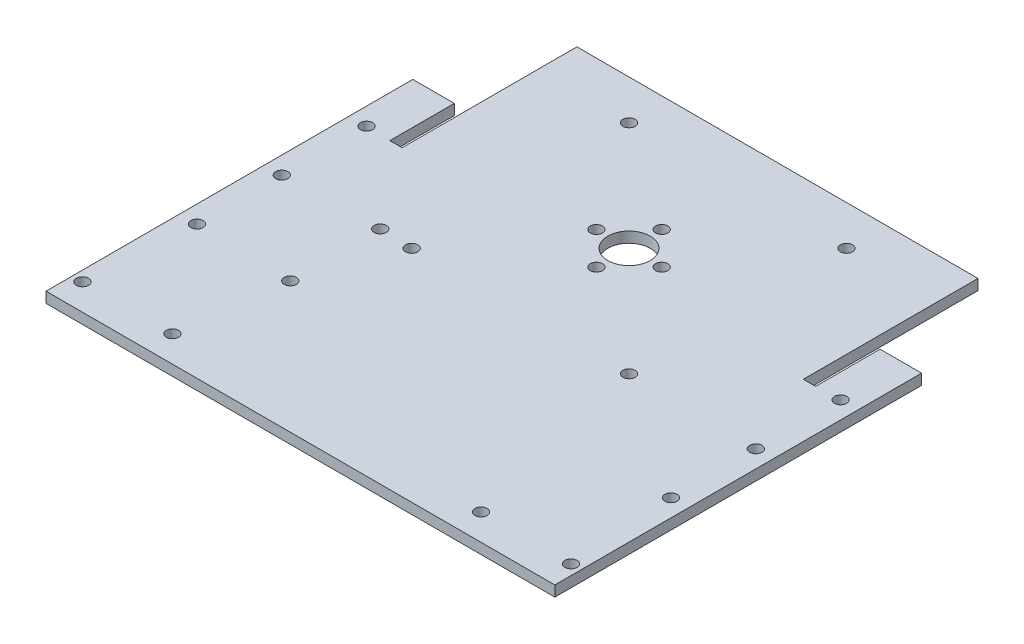
ISO-10303-21;
HEADER;
FILE_DESCRIPTION(('STEP AP214'),'2;1');
FILE_NAME('part.step','',(''),(''),'','','');
FILE_SCHEMA(('AUTOMOTIVE_DESIGN { 1 0 10303 214 1 1 1 1 }'));
ENDSEC;
DATA;
#1=APPLICATION_CONTEXT('core data for automotive mechanical design processes');
#2=APPLICATION_PROTOCOL_DEFINITION('international standard','automotive_design',2000,#1);
#3=PRODUCT_CONTEXT('',#1,'mechanical');
#4=PRODUCT('Part','Part','',(#3));
#5=PRODUCT_RELATED_PRODUCT_CATEGORY('part','',(#4));
#6=PRODUCT_DEFINITION_FORMATION('','',#4);
#7=PRODUCT_DEFINITION_CONTEXT('part definition',#1,'design');
#8=PRODUCT_DEFINITION('design','',#6,#7);
#9=PRODUCT_DEFINITION_SHAPE('','',#8);
#10=(LENGTH_UNIT() NAMED_UNIT(*) SI_UNIT(.MILLI.,.METRE.));
#11=(NAMED_UNIT(*) PLANE_ANGLE_UNIT() SI_UNIT($,.RADIAN.));
#12=(NAMED_UNIT(*) SI_UNIT($,.STERADIAN.) SOLID_ANGLE_UNIT());
#13=UNCERTAINTY_MEASURE_WITH_UNIT(LENGTH_MEASURE(1.E-05),#10,'distance_accuracy_value','');
#14=(GEOMETRIC_REPRESENTATION_CONTEXT(3) GLOBAL_UNCERTAINTY_ASSIGNED_CONTEXT((#13)) GLOBAL_UNIT_ASSIGNED_CONTEXT((#10,
#11,#12)) REPRESENTATION_CONTEXT('',''));
#15=CARTESIAN_POINT('',(0.,0.,0.));
#16=DIRECTION('',(0.,0.,1.));
#17=DIRECTION('',(1.,0.,0.));
#18=AXIS2_PLACEMENT_3D('',#15,#16,#17);
#19=CARTESIAN_POINT('',(76.2,3.175,-44.45));
#20=DIRECTION('',(0.,0.,1.));
#21=DIRECTION('',(1.,0.,0.));
#22=AXIS2_PLACEMENT_3D('',#19,#20,#21);
#23=PLANE('',#22);
#24=DIRECTION('',(-1.,0.,0.));
#25=VECTOR('',#24,1.);
#26=CARTESIAN_POINT('',(76.2,3.175,-44.45));
#27=LINE('',#26,#25);
#28=CARTESIAN_POINT('',(-63.754,3.175,-44.45));
#29=VERTEX_POINT('',#28);
#30=CARTESIAN_POINT('',(-76.2,3.175,-44.45));
#31=VERTEX_POINT('',#30);
#32=EDGE_CURVE('E268',#29,#31,#27,.T.);
#33=ORIENTED_EDGE('',*,*,#32,.F.);
#34=DIRECTION('',(0.,1.,0.));
#35=VECTOR('',#34,1.);
#36=CARTESIAN_POINT('',(-63.754,0.,-44.45));
#37=LINE('',#36,#35);
#38=CARTESIAN_POINT('',(-63.754,0.,-44.45));
#39=VERTEX_POINT('',#38);
#40=EDGE_CURVE('E214',#39,#29,#37,.T.);
#41=ORIENTED_EDGE('',*,*,#40,.F.);
#42=DIRECTION('',(-1.,0.,0.));
#43=VECTOR('',#42,1.);
#44=CARTESIAN_POINT('',(76.2,0.,-44.45));
#45=LINE('',#44,#43);
#46=CARTESIAN_POINT('',(-76.2,0.,-44.45));
#47=VERTEX_POINT('',#46);
#48=EDGE_CURVE('E275',#39,#47,#45,.T.);
#49=ORIENTED_EDGE('',*,*,#48,.T.);
#50=DIRECTION('',(0.,-1.,0.));
#51=VECTOR('',#50,1.);
#52=CARTESIAN_POINT('',(-76.2,3.175,-44.45));
#53=LINE('',#52,#51);
#54=EDGE_CURVE('E41',#31,#47,#53,.T.);
#55=ORIENTED_EDGE('',*,*,#54,.F.);
#56=EDGE_LOOP('',(#33,#41,#49,#55));
#57=FACE_BOUND('',#56,.T.);
#58=ADVANCED_FACE('F33',(#57),#23,.F.);
#59=CARTESIAN_POINT('',(-76.2,3.175,44.45));
#60=DIRECTION('',(1.,0.,0.));
#61=DIRECTION('',(0.,0.,-1.));
#62=AXIS2_PLACEMENT_3D('',#59,#60,#61);
#63=PLANE('',#62);
#64=DIRECTION('',(0.,0.,1.));
#65=VECTOR('',#64,1.);
#66=CARTESIAN_POINT('',(-76.2,0.,44.45));
#67=LINE('',#66,#65);
#68=CARTESIAN_POINT('',(-76.2,0.,65.405));
#69=VERTEX_POINT('',#68);
#70=EDGE_CURVE('E260',#47,#69,#67,.T.);
#71=ORIENTED_EDGE('',*,*,#70,.T.);
#72=DIRECTION('',(0.,1.,0.));
#73=VECTOR('',#72,1.);
#74=CARTESIAN_POINT('',(-76.2,0.,65.405));
#75=LINE('',#74,#73);
#76=CARTESIAN_POINT('',(-76.2,3.175,65.405));
#77=VERTEX_POINT('',#76);
#78=EDGE_CURVE('E183',#69,#77,#75,.T.);
#79=ORIENTED_EDGE('',*,*,#78,.T.);
#80=DIRECTION('',(0.,0.,1.));
#81=VECTOR('',#80,1.);
#82=CARTESIAN_POINT('',(-76.2,3.175,44.45));
#83=LINE('',#82,#81);
#84=EDGE_CURVE('E263',#31,#77,#83,.T.);
#85=ORIENTED_EDGE('',*,*,#84,.F.);
#86=ORIENTED_EDGE('',*,*,#54,.T.);
#87=EDGE_LOOP('',(#71,#79,#85,#86));
#88=FACE_BOUND('',#87,.T.);
#89=ADVANCED_FACE('F35',(#88),#63,.F.);
#90=CARTESIAN_POINT('',(76.2,3.175,44.45));
#91=DIRECTION('',(-1.,0.,0.));
#92=DIRECTION('',(0.,0.,1.));
#93=AXIS2_PLACEMENT_3D('',#90,#91,#92);
#94=PLANE('',#93);
#95=DIRECTION('',(0.,0.,-1.));
#96=VECTOR('',#95,1.);
#97=CARTESIAN_POINT('',(76.2,0.,44.45));
#98=LINE('',#97,#96);
#99=CARTESIAN_POINT('',(76.2,0.,65.405));
#100=VERTEX_POINT('',#99);
#101=CARTESIAN_POINT('',(76.2,0.,-44.45));
#102=VERTEX_POINT('',#101);
#103=EDGE_CURVE('E273',#100,#102,#98,.T.);
#104=ORIENTED_EDGE('',*,*,#103,.T.);
#105=DIRECTION('',(0.,-1.,0.));
#106=VECTOR('',#105,1.);
#107=CARTESIAN_POINT('',(76.2,3.175,-44.45));
#108=LINE('',#107,#106);
#109=CARTESIAN_POINT('',(76.2,3.175,-44.45));
#110=VERTEX_POINT('',#109);
#111=EDGE_CURVE('E11',#110,#102,#108,.T.);
#112=ORIENTED_EDGE('',*,*,#111,.F.);
#113=DIRECTION('',(0.,0.,-1.));
#114=VECTOR('',#113,1.);
#115=CARTESIAN_POINT('',(76.2,3.175,44.45));
#116=LINE('',#115,#114);
#117=CARTESIAN_POINT('',(76.2,3.175,65.405));
#118=VERTEX_POINT('',#117);
#119=EDGE_CURVE('E265',#118,#110,#116,.T.);
#120=ORIENTED_EDGE('',*,*,#119,.F.);
#121=DIRECTION('',(0.,1.,0.));
#122=VECTOR('',#121,1.);
#123=CARTESIAN_POINT('',(76.2,0.,65.405));
#124=LINE('',#123,#122);
#125=EDGE_CURVE('E186',#100,#118,#124,.T.);
#126=ORIENTED_EDGE('',*,*,#125,.F.);
#127=EDGE_LOOP('',(#104,#112,#120,#126));
#128=FACE_BOUND('',#127,.T.);
#129=ADVANCED_FACE('F327',(#128),#94,.F.);
#130=CARTESIAN_POINT('',(63.754,0.,-44.4499999999999));
#131=VERTEX_POINT('',#130);
#132=EDGE_CURVE('E266',#102,#131,#45,.T.);
#133=ORIENTED_EDGE('',*,*,#132,.T.);
#134=DIRECTION('',(0.,1.,0.));
#135=VECTOR('',#134,1.);
#136=CARTESIAN_POINT('',(63.754,0.,-44.4499999999999));
#137=LINE('',#136,#135);
#138=CARTESIAN_POINT('',(63.754,3.175,-44.4499999999999));
#139=VERTEX_POINT('',#138);
#140=EDGE_CURVE('E201',#131,#139,#137,.T.);
#141=ORIENTED_EDGE('',*,*,#140,.T.);
#142=EDGE_CURVE('E269',#110,#139,#27,.T.);
#143=ORIENTED_EDGE('',*,*,#142,.F.);
#144=ORIENTED_EDGE('',*,*,#111,.T.);
#145=EDGE_LOOP('',(#133,#141,#143,#144));
#146=FACE_BOUND('',#145,.T.);
#147=ADVANCED_FACE('F321',(#146),#23,.F.);
#148=CARTESIAN_POINT('',(0.,3.175,0.));
#149=DIRECTION('',(0.,1.,0.));
#150=DIRECTION('',(0.,0.,1.));
#151=AXIS2_PLACEMENT_3D('',#148,#149,#150);
#152=PLANE('',#151);
#153=CARTESIAN_POINT('',(-42.291,3.175,-0.787399999999994));
#154=DIRECTION('',(0.,-1.,0.));
#155=DIRECTION('',(0.,0.,-1.));
#156=AXIS2_PLACEMENT_3D('',#153,#154,#155);
#157=CIRCLE('',#156,1.8288);
#158=CARTESIAN_POINT('',(-42.291,3.175,-2.61619999999999));
#159=VERTEX_POINT('',#158);
#160=EDGE_CURVE('E422',#159,#159,#157,.T.);
#161=ORIENTED_EDGE('',*,*,#160,.T.);
#162=EDGE_LOOP('',(#161));
#163=FACE_BOUND('',#162,.T.);
#164=CARTESIAN_POINT('',(-42.291,3.175,26.162));
#165=DIRECTION('',(0.,-1.,0.));
#166=DIRECTION('',(0.,0.,-1.));
#167=AXIS2_PLACEMENT_3D('',#164,#165,#166);
#168=CIRCLE('',#167,1.82880000000001);
#169=CARTESIAN_POINT('',(-42.291,3.175,24.3332));
#170=VERTEX_POINT('',#169);
#171=EDGE_CURVE('E431',#170,#170,#168,.T.);
#172=ORIENTED_EDGE('',*,*,#171,.T.);
#173=EDGE_LOOP('',(#172));
#174=FACE_BOUND('',#173,.T.);
#175=CARTESIAN_POINT('',(9.779,3.175,-33.02));
#176=DIRECTION('',(0.,1.,0.));
#177=DIRECTION('',(0.,0.,1.));
#178=AXIS2_PLACEMENT_3D('',#175,#176,#177);
#179=CIRCLE('',#178,1.8288);
#180=CARTESIAN_POINT('',(9.779,3.175,-31.1912));
#181=VERTEX_POINT('',#180);
#182=EDGE_CURVE('E439',#181,#181,#179,.T.);
#183=ORIENTED_EDGE('',*,*,#182,.F.);
#184=EDGE_LOOP('',(#183));
#185=FACE_BOUND('',#184,.T.);
#186=CARTESIAN_POINT('',(0.,3.175,-42.799));
#187=DIRECTION('',(0.,1.,0.));
#188=DIRECTION('',(0.,0.,1.));
#189=AXIS2_PLACEMENT_3D('',#186,#187,#188);
#190=CIRCLE('',#189,1.8288);
#191=CARTESIAN_POINT('',(0.,3.175,-40.9702));
#192=VERTEX_POINT('',#191);
#193=EDGE_CURVE('E445',#192,#192,#190,.T.);
#194=ORIENTED_EDGE('',*,*,#193,.F.);
#195=EDGE_LOOP('',(#194));
#196=FACE_BOUND('',#195,.T.);
#197=CARTESIAN_POINT('',(-9.77899999999999,3.175,-33.02));
#198=DIRECTION('',(0.,1.,0.));
#199=DIRECTION('',(0.,0.,1.));
#200=AXIS2_PLACEMENT_3D('',#197,#198,#199);
#201=CIRCLE('',#200,1.8288);
#202=CARTESIAN_POINT('',(-9.77899999999999,3.175,-31.1912));
#203=VERTEX_POINT('',#202);
#204=EDGE_CURVE('E451',#203,#203,#201,.T.);
#205=ORIENTED_EDGE('',*,*,#204,.F.);
#206=EDGE_LOOP('',(#205));
#207=FACE_BOUND('',#206,.T.);
#208=CARTESIAN_POINT('',(0.,3.175,-23.241));
#209=DIRECTION('',(0.,1.,0.));
#210=DIRECTION('',(0.,0.,1.));
#211=AXIS2_PLACEMENT_3D('',#208,#209,#210);
#212=CIRCLE('',#211,1.8288);
#213=CARTESIAN_POINT('',(0.,3.175,-21.4122));
#214=VERTEX_POINT('',#213);
#215=EDGE_CURVE('E457',#214,#214,#212,.T.);
#216=ORIENTED_EDGE('',*,*,#215,.F.);
#217=EDGE_LOOP('',(#216));
#218=FACE_BOUND('',#217,.T.);
#219=CARTESIAN_POINT('',(32.5501,3.175,-65.5701));
#220=DIRECTION('',(0.,1.,0.));
#221=DIRECTION('',(0.,0.,1.));
#222=AXIS2_PLACEMENT_3D('',#219,#220,#221);
#223=CIRCLE('',#222,1.8288);
#224=CARTESIAN_POINT('',(32.5501,3.175,-63.7413));
#225=VERTEX_POINT('',#224);
#226=EDGE_CURVE('E460',#225,#225,#223,.T.);
#227=ORIENTED_EDGE('',*,*,#226,.F.);
#228=EDGE_LOOP('',(#227));
#229=FACE_BOUND('',#228,.T.);
#230=CARTESIAN_POINT('',(-32.5501,3.175,-65.5701));
#231=DIRECTION('',(0.,1.,0.));
#232=DIRECTION('',(0.,0.,1.));
#233=AXIS2_PLACEMENT_3D('',#230,#231,#232);
#234=CIRCLE('',#233,1.8288);
#235=CARTESIAN_POINT('',(-32.5501,3.175,-63.7413));
#236=VERTEX_POINT('',#235);
#237=EDGE_CURVE('E464',#236,#236,#234,.T.);
#238=ORIENTED_EDGE('',*,*,#237,.F.);
#239=EDGE_LOOP('',(#238));
#240=FACE_BOUND('',#239,.T.);
#241=CARTESIAN_POINT('',(-32.5501,3.175,-0.469900000000034));
#242=DIRECTION('',(0.,1.,0.));
#243=DIRECTION('',(0.,0.,1.));
#244=AXIS2_PLACEMENT_3D('',#241,#242,#243);
#245=CIRCLE('',#244,1.8288);
#246=CARTESIAN_POINT('',(-32.5501,3.175,1.35889999999996));
#247=VERTEX_POINT('',#246);
#248=EDGE_CURVE('E470',#247,#247,#245,.T.);
#249=ORIENTED_EDGE('',*,*,#248,.F.);
#250=EDGE_LOOP('',(#249));
#251=FACE_BOUND('',#250,.T.);
#252=CARTESIAN_POINT('',(32.5501,3.175,-0.469900000000034));
#253=DIRECTION('',(0.,1.,0.));
#254=DIRECTION('',(0.,0.,1.));
#255=AXIS2_PLACEMENT_3D('',#252,#253,#254);
#256=CIRCLE('',#255,1.8288);
#257=CARTESIAN_POINT('',(32.5501,3.175,1.35889999999996));
#258=VERTEX_POINT('',#257);
#259=EDGE_CURVE('E476',#258,#258,#256,.T.);
#260=ORIENTED_EDGE('',*,*,#259,.F.);
#261=EDGE_LOOP('',(#260));
#262=FACE_BOUND('',#261,.T.);
#263=CARTESIAN_POINT('',(0.,3.175,-33.02));
#264=DIRECTION('',(0.,1.,0.));
#265=DIRECTION('',(0.,0.,1.));
#266=AXIS2_PLACEMENT_3D('',#263,#264,#265);
#267=CIRCLE('',#266,6.35);
#268=CARTESIAN_POINT('',(0.,3.175,-26.67));
#269=VERTEX_POINT('',#268);
#270=EDGE_CURVE('E151',#269,#269,#267,.T.);
#271=ORIENTED_EDGE('',*,*,#270,.F.);
#272=EDGE_LOOP('',(#271));
#273=FACE_BOUND('',#272,.T.);
#274=DIRECTION('',(1.,0.,0.));
#275=VECTOR('',#274,1.);
#276=CARTESIAN_POINT('',(60.071,3.175,-25.146));
#277=LINE('',#276,#275);
#278=CARTESIAN_POINT('',(60.071,3.175,-25.146));
#279=VERTEX_POINT('',#278);
#280=CARTESIAN_POINT('',(63.754,3.175,-25.146));
#281=VERTEX_POINT('',#280);
#282=EDGE_CURVE('E197',#279,#281,#277,.T.);
#283=ORIENTED_EDGE('',*,*,#282,.F.);
#284=DIRECTION('',(0.,0.,1.));
#285=VECTOR('',#284,1.);
#286=CARTESIAN_POINT('',(60.071,3.175,-44.4499999999999));
#287=LINE('',#286,#285);
#288=CARTESIAN_POINT('',(60.071,3.175,-77.47));
#289=VERTEX_POINT('',#288);
#290=EDGE_CURVE('E189',#289,#279,#287,.T.);
#291=ORIENTED_EDGE('',*,*,#290,.F.);
#292=DIRECTION('',(-1.,0.,0.));
#293=VECTOR('',#292,1.);
#294=CARTESIAN_POINT('',(60.071,3.175,-77.47));
#295=LINE('',#294,#293);
#296=CARTESIAN_POINT('',(-60.071,3.175,-77.47));
#297=VERTEX_POINT('',#296);
#298=EDGE_CURVE('E139',#289,#297,#295,.T.);
#299=ORIENTED_EDGE('',*,*,#298,.T.);
#300=DIRECTION('',(0.,0.,-1.));
#301=VECTOR('',#300,1.);
#302=CARTESIAN_POINT('',(-60.071,3.175,-25.146));
#303=LINE('',#302,#301);
#304=CARTESIAN_POINT('',(-60.071,3.175,-25.146));
#305=VERTEX_POINT('',#304);
#306=EDGE_CURVE('E211',#305,#297,#303,.T.);
#307=ORIENTED_EDGE('',*,*,#306,.F.);
#308=DIRECTION('',(1.,0.,0.));
#309=VECTOR('',#308,1.);
#310=CARTESIAN_POINT('',(-63.754,3.175,-25.146));
#311=LINE('',#310,#309);
#312=CARTESIAN_POINT('',(-63.754,3.175,-25.146));
#313=VERTEX_POINT('',#312);
#314=EDGE_CURVE('E217',#313,#305,#311,.T.);
#315=ORIENTED_EDGE('',*,*,#314,.F.);
#316=DIRECTION('',(0.,0.,1.));
#317=VECTOR('',#316,1.);
#318=CARTESIAN_POINT('',(-63.754,3.175,-44.45));
#319=LINE('',#318,#317);
#320=EDGE_CURVE('E204',#29,#313,#319,.T.);
#321=ORIENTED_EDGE('',*,*,#320,.F.);
#322=ORIENTED_EDGE('',*,*,#32,.T.);
#323=ORIENTED_EDGE('',*,*,#84,.T.);
#324=DIRECTION('',(1.,0.,0.));
#325=VECTOR('',#324,1.);
#326=CARTESIAN_POINT('',(-76.2,3.175,65.405));
#327=LINE('',#326,#325);
#328=EDGE_CURVE('E177',#77,#118,#327,.T.);
#329=ORIENTED_EDGE('',*,*,#328,.T.);
#330=ORIENTED_EDGE('',*,*,#119,.T.);
#331=ORIENTED_EDGE('',*,*,#142,.T.);
#332=DIRECTION('',(0.,0.,-1.));
#333=VECTOR('',#332,1.);
#334=CARTESIAN_POINT('',(63.754,3.175,-25.146));
#335=LINE('',#334,#333);
#336=EDGE_CURVE('E131',#281,#139,#335,.T.);
#337=ORIENTED_EDGE('',*,*,#336,.F.);
#338=EDGE_LOOP('',(#283,#291,#299,#307,#315,#321,#322,#323,#329,#330,#331,#337));
#339=FACE_BOUND('',#338,.T.);
#340=CARTESIAN_POINT('',(73.1647,3.175,57.531));
#341=DIRECTION('',(0.,1.,0.));
#342=DIRECTION('',(0.,0.,-1.));
#343=AXIS2_PLACEMENT_3D('',#340,#341,#342);
#344=CIRCLE('',#343,1.8288);
#345=CARTESIAN_POINT('',(73.1647,3.175,55.7022));
#346=VERTEX_POINT('',#345);
#347=EDGE_CURVE('E154',#346,#346,#344,.T.);
#348=ORIENTED_EDGE('',*,*,#347,.F.);
#349=EDGE_LOOP('',(#348));
#350=FACE_BOUND('',#349,.T.);
#351=CARTESIAN_POINT('',(46.2153,3.175,57.531));
#352=DIRECTION('',(0.,1.,0.));
#353=DIRECTION('',(0.,0.,-1.));
#354=AXIS2_PLACEMENT_3D('',#351,#352,#353);
#355=CIRCLE('',#354,1.8288);
#356=CARTESIAN_POINT('',(46.2153,3.175,55.7022));
#357=VERTEX_POINT('',#356);
#358=EDGE_CURVE('E159',#357,#357,#355,.T.);
#359=ORIENTED_EDGE('',*,*,#358,.F.);
#360=EDGE_LOOP('',(#359));
#361=FACE_BOUND('',#360,.T.);
#362=CARTESIAN_POINT('',(-46.2153,3.175,57.531));
#363=DIRECTION('',(0.,1.,0.));
#364=DIRECTION('',(0.,0.,1.));
#365=AXIS2_PLACEMENT_3D('',#362,#363,#364);
#366=CIRCLE('',#365,1.8288);
#367=CARTESIAN_POINT('',(-46.2153,3.175,59.3598));
#368=VERTEX_POINT('',#367);
#369=EDGE_CURVE('E165',#368,#368,#366,.T.);
#370=ORIENTED_EDGE('',*,*,#369,.F.);
#371=EDGE_LOOP('',(#370));
#372=FACE_BOUND('',#371,.T.);
#373=CARTESIAN_POINT('',(-73.1647,3.175,57.531));
#374=DIRECTION('',(0.,1.,0.));
#375=DIRECTION('',(0.,0.,1.));
#376=AXIS2_PLACEMENT_3D('',#373,#374,#375);
#377=CIRCLE('',#376,1.8288);
#378=CARTESIAN_POINT('',(-73.1647,3.175,59.3598));
#379=VERTEX_POINT('',#378);
#380=EDGE_CURVE('E171',#379,#379,#377,.T.);
#381=ORIENTED_EDGE('',*,*,#380,.F.);
#382=EDGE_LOOP('',(#381));
#383=FACE_BOUND('',#382,.T.);
#384=CARTESIAN_POINT('',(70.993,3.175,-25.4));
#385=DIRECTION('',(0.,1.,0.));
#386=DIRECTION('',(0.,0.,-1.));
#387=AXIS2_PLACEMENT_3D('',#384,#385,#386);
#388=CIRCLE('',#387,1.8288);
#389=CARTESIAN_POINT('',(70.993,3.175,-27.2288));
#390=VERTEX_POINT('',#389);
#391=EDGE_CURVE('E223',#390,#390,#388,.T.);
#392=ORIENTED_EDGE('',*,*,#391,.F.);
#393=EDGE_LOOP('',(#392));
#394=FACE_BOUND('',#393,.T.);
#395=CARTESIAN_POINT('',(70.993,3.175,0.));
#396=DIRECTION('',(0.,1.,0.));
#397=DIRECTION('',(0.,0.,-1.));
#398=AXIS2_PLACEMENT_3D('',#395,#396,#397);
#399=CIRCLE('',#398,1.82879999999998);
#400=CARTESIAN_POINT('',(70.993,3.175,-1.8288));
#401=VERTEX_POINT('',#400);
#402=EDGE_CURVE('E230',#401,#401,#399,.T.);
#403=ORIENTED_EDGE('',*,*,#402,.F.);
#404=EDGE_LOOP('',(#403));
#405=FACE_BOUND('',#404,.T.);
#406=CARTESIAN_POINT('',(70.993,3.175,25.4));
#407=DIRECTION('',(0.,1.,0.));
#408=DIRECTION('',(0.,0.,-1.));
#409=AXIS2_PLACEMENT_3D('',#406,#407,#408);
#410=CIRCLE('',#409,1.8288);
#411=CARTESIAN_POINT('',(70.993,3.175,23.5712));
#412=VERTEX_POINT('',#411);
#413=EDGE_CURVE('E236',#412,#412,#410,.T.);
#414=ORIENTED_EDGE('',*,*,#413,.F.);
#415=EDGE_LOOP('',(#414));
#416=FACE_BOUND('',#415,.T.);
#417=CARTESIAN_POINT('',(-70.993,3.175,-25.4));
#418=DIRECTION('',(0.,1.,0.));
#419=DIRECTION('',(0.,0.,1.));
#420=AXIS2_PLACEMENT_3D('',#417,#418,#419);
#421=CIRCLE('',#420,1.8288);
#422=CARTESIAN_POINT('',(-70.993,3.175,-23.5712));
#423=VERTEX_POINT('',#422);
#424=EDGE_CURVE('E242',#423,#423,#421,.T.);
#425=ORIENTED_EDGE('',*,*,#424,.F.);
#426=EDGE_LOOP('',(#425));
#427=FACE_BOUND('',#426,.T.);
#428=CARTESIAN_POINT('',(-70.993,3.175,0.));
#429=DIRECTION('',(0.,1.,0.));
#430=DIRECTION('',(0.,0.,1.));
#431=AXIS2_PLACEMENT_3D('',#428,#429,#430);
#432=CIRCLE('',#431,1.8288);
#433=CARTESIAN_POINT('',(-70.993,3.175,1.8288));
#434=VERTEX_POINT('',#433);
#435=EDGE_CURVE('E248',#434,#434,#432,.T.);
#436=ORIENTED_EDGE('',*,*,#435,.F.);
#437=EDGE_LOOP('',(#436));
#438=FACE_BOUND('',#437,.T.);
#439=CARTESIAN_POINT('',(-70.993,3.175,25.4));
#440=DIRECTION('',(0.,1.,0.));
#441=DIRECTION('',(0.,0.,1.));
#442=AXIS2_PLACEMENT_3D('',#439,#440,#441);
#443=CIRCLE('',#442,1.8288);
#444=CARTESIAN_POINT('',(-70.993,3.175,27.2288));
#445=VERTEX_POINT('',#444);
#446=EDGE_CURVE('E254',#445,#445,#443,.T.);
#447=ORIENTED_EDGE('',*,*,#446,.F.);
#448=EDGE_LOOP('',(#447));
#449=FACE_BOUND('',#448,.T.);
#450=ADVANCED_FACE('F294',(#163,#174,#185,#196,#207,#218,#229,#240,#251,#262,#273,#339,#350,
#361,#372,#383,#394,#405,#416,#427,#438,#449),#152,.T.);
#451=CARTESIAN_POINT('',(0.,0.,0.));
#452=DIRECTION('',(0.,1.,0.));
#453=DIRECTION('',(0.,0.,1.));
#454=AXIS2_PLACEMENT_3D('',#451,#452,#453);
#455=PLANE('',#454);
#456=CARTESIAN_POINT('',(-42.291,0.,-0.787399999999994));
#457=DIRECTION('',(0.,-1.,0.));
#458=DIRECTION('',(0.,0.,-1.));
#459=AXIS2_PLACEMENT_3D('',#456,#457,#458);
#460=CIRCLE('',#459,1.8288);
#461=CARTESIAN_POINT('',(-42.291,0.,-2.61619999999999));
#462=VERTEX_POINT('',#461);
#463=EDGE_CURVE('E425',#462,#462,#460,.T.);
#464=ORIENTED_EDGE('',*,*,#463,.F.);
#465=EDGE_LOOP('',(#464));
#466=FACE_BOUND('',#465,.T.);
#467=CARTESIAN_POINT('',(-42.291,0.,26.162));
#468=DIRECTION('',(0.,-1.,0.));
#469=DIRECTION('',(0.,0.,-1.));
#470=AXIS2_PLACEMENT_3D('',#467,#468,#469);
#471=CIRCLE('',#470,1.82880000000001);
#472=CARTESIAN_POINT('',(-42.291,0.,24.3332));
#473=VERTEX_POINT('',#472);
#474=EDGE_CURVE('E428',#473,#473,#471,.T.);
#475=ORIENTED_EDGE('',*,*,#474,.F.);
#476=EDGE_LOOP('',(#475));
#477=FACE_BOUND('',#476,.T.);
#478=CARTESIAN_POINT('',(9.779,0.,-33.02));
#479=DIRECTION('',(0.,-1.,0.));
#480=DIRECTION('',(0.,0.,1.));
#481=AXIS2_PLACEMENT_3D('',#478,#479,#480);
#482=CIRCLE('',#481,1.8288);
#483=CARTESIAN_POINT('',(9.779,0.,-31.1912));
#484=VERTEX_POINT('',#483);
#485=EDGE_CURVE('E434',#484,#484,#482,.T.);
#486=ORIENTED_EDGE('',*,*,#485,.F.);
#487=EDGE_LOOP('',(#486));
#488=FACE_BOUND('',#487,.T.);
#489=CARTESIAN_POINT('',(0.,0.,-42.799));
#490=DIRECTION('',(0.,-1.,0.));
#491=DIRECTION('',(0.,0.,1.));
#492=AXIS2_PLACEMENT_3D('',#489,#490,#491);
#493=CIRCLE('',#492,1.8288);
#494=CARTESIAN_POINT('',(0.,0.,-40.9702));
#495=VERTEX_POINT('',#494);
#496=EDGE_CURVE('E442',#495,#495,#493,.T.);
#497=ORIENTED_EDGE('',*,*,#496,.F.);
#498=EDGE_LOOP('',(#497));
#499=FACE_BOUND('',#498,.T.);
#500=CARTESIAN_POINT('',(-9.77899999999999,0.,-33.02));
#501=DIRECTION('',(0.,-1.,0.));
#502=DIRECTION('',(0.,0.,-1.));
#503=AXIS2_PLACEMENT_3D('',#500,#501,#502);
#504=CIRCLE('',#503,1.8288);
#505=CARTESIAN_POINT('',(-9.77899999999999,0.,-34.8488));
#506=VERTEX_POINT('',#505);
#507=EDGE_CURVE('E448',#506,#506,#504,.T.);
#508=ORIENTED_EDGE('',*,*,#507,.F.);
#509=EDGE_LOOP('',(#508));
#510=FACE_BOUND('',#509,.T.);
#511=CARTESIAN_POINT('',(0.,0.,-23.241));
#512=DIRECTION('',(0.,-1.,0.));
#513=DIRECTION('',(0.,0.,-1.));
#514=AXIS2_PLACEMENT_3D('',#511,#512,#513);
#515=CIRCLE('',#514,1.8288);
#516=CARTESIAN_POINT('',(0.,0.,-25.0698));
#517=VERTEX_POINT('',#516);
#518=EDGE_CURVE('E454',#517,#517,#515,.T.);
#519=ORIENTED_EDGE('',*,*,#518,.F.);
#520=EDGE_LOOP('',(#519));
#521=FACE_BOUND('',#520,.T.);
#522=CARTESIAN_POINT('',(32.5501,0.,-65.5701));
#523=DIRECTION('',(0.,1.,0.));
#524=DIRECTION('',(0.,0.,1.));
#525=AXIS2_PLACEMENT_3D('',#522,#523,#524);
#526=CIRCLE('',#525,1.8288);
#527=CARTESIAN_POINT('',(32.5501,0.,-63.7413));
#528=VERTEX_POINT('',#527);
#529=EDGE_CURVE('E461',#528,#528,#526,.T.);
#530=ORIENTED_EDGE('',*,*,#529,.T.);
#531=EDGE_LOOP('',(#530));
#532=FACE_BOUND('',#531,.T.);
#533=CARTESIAN_POINT('',(-32.5501,0.,-65.5701));
#534=DIRECTION('',(0.,1.,0.));
#535=DIRECTION('',(0.,0.,1.));
#536=AXIS2_PLACEMENT_3D('',#533,#534,#535);
#537=CIRCLE('',#536,1.8288);
#538=CARTESIAN_POINT('',(-32.5501,0.,-63.7413));
#539=VERTEX_POINT('',#538);
#540=EDGE_CURVE('E467',#539,#539,#537,.T.);
#541=ORIENTED_EDGE('',*,*,#540,.T.);
#542=EDGE_LOOP('',(#541));
#543=FACE_BOUND('',#542,.T.);
#544=CARTESIAN_POINT('',(-32.5501,0.,-0.469900000000034));
#545=DIRECTION('',(0.,1.,0.));
#546=DIRECTION('',(0.,0.,1.));
#547=AXIS2_PLACEMENT_3D('',#544,#545,#546);
#548=CIRCLE('',#547,1.8288);
#549=CARTESIAN_POINT('',(-32.5501,0.,1.35889999999996));
#550=VERTEX_POINT('',#549);
#551=EDGE_CURVE('E473',#550,#550,#548,.T.);
#552=ORIENTED_EDGE('',*,*,#551,.T.);
#553=EDGE_LOOP('',(#552));
#554=FACE_BOUND('',#553,.T.);
#555=CARTESIAN_POINT('',(32.5501,0.,-0.469900000000034));
#556=DIRECTION('',(0.,1.,0.));
#557=DIRECTION('',(0.,0.,1.));
#558=AXIS2_PLACEMENT_3D('',#555,#556,#557);
#559=CIRCLE('',#558,1.8288);
#560=CARTESIAN_POINT('',(32.5501,0.,1.35889999999996));
#561=VERTEX_POINT('',#560);
#562=EDGE_CURVE('E479',#561,#561,#559,.T.);
#563=ORIENTED_EDGE('',*,*,#562,.T.);
#564=EDGE_LOOP('',(#563));
#565=FACE_BOUND('',#564,.T.);
#566=CARTESIAN_POINT('',(0.,0.,-33.02));
#567=DIRECTION('',(0.,1.,0.));
#568=DIRECTION('',(0.,0.,1.));
#569=AXIS2_PLACEMENT_3D('',#566,#567,#568);
#570=CIRCLE('',#569,6.35);
#571=CARTESIAN_POINT('',(0.,0.,-26.67));
#572=VERTEX_POINT('',#571);
#573=EDGE_CURVE('E148',#572,#572,#570,.T.);
#574=ORIENTED_EDGE('',*,*,#573,.T.);
#575=EDGE_LOOP('',(#574));
#576=FACE_BOUND('',#575,.T.);
#577=DIRECTION('',(0.,0.,1.));
#578=VECTOR('',#577,1.);
#579=CARTESIAN_POINT('',(60.071,0.,-44.4499999999999));
#580=LINE('',#579,#578);
#581=CARTESIAN_POINT('',(60.071,0.,-77.47));
#582=VERTEX_POINT('',#581);
#583=CARTESIAN_POINT('',(60.071,0.,-25.146));
#584=VERTEX_POINT('',#583);
#585=EDGE_CURVE('E122',#582,#584,#580,.T.);
#586=ORIENTED_EDGE('',*,*,#585,.T.);
#587=DIRECTION('',(1.,0.,0.));
#588=VECTOR('',#587,1.);
#589=CARTESIAN_POINT('',(60.071,0.,-25.146));
#590=LINE('',#589,#588);
#591=CARTESIAN_POINT('',(63.754,0.,-25.146));
#592=VERTEX_POINT('',#591);
#593=EDGE_CURVE('E48',#584,#592,#590,.T.);
#594=ORIENTED_EDGE('',*,*,#593,.T.);
#595=DIRECTION('',(0.,0.,-1.));
#596=VECTOR('',#595,1.);
#597=CARTESIAN_POINT('',(63.754,0.,-25.146));
#598=LINE('',#597,#596);
#599=EDGE_CURVE('E193',#592,#131,#598,.T.);
#600=ORIENTED_EDGE('',*,*,#599,.T.);
#601=ORIENTED_EDGE('',*,*,#132,.F.);
#602=ORIENTED_EDGE('',*,*,#103,.F.);
#603=DIRECTION('',(1.,0.,0.));
#604=VECTOR('',#603,1.);
#605=CARTESIAN_POINT('',(-76.2,0.,65.405));
#606=LINE('',#605,#604);
#607=EDGE_CURVE('E180',#69,#100,#606,.T.);
#608=ORIENTED_EDGE('',*,*,#607,.F.);
#609=ORIENTED_EDGE('',*,*,#70,.F.);
#610=ORIENTED_EDGE('',*,*,#48,.F.);
#611=DIRECTION('',(0.,0.,1.));
#612=VECTOR('',#611,1.);
#613=CARTESIAN_POINT('',(-63.754,0.,-44.45));
#614=LINE('',#613,#612);
#615=CARTESIAN_POINT('',(-63.754,0.,-25.146));
#616=VERTEX_POINT('',#615);
#617=EDGE_CURVE('E208',#39,#616,#614,.T.);
#618=ORIENTED_EDGE('',*,*,#617,.T.);
#619=DIRECTION('',(1.,0.,0.));
#620=VECTOR('',#619,1.);
#621=CARTESIAN_POINT('',(-63.754,0.,-25.146));
#622=LINE('',#621,#620);
#623=CARTESIAN_POINT('',(-60.071,0.,-25.146));
#624=VERTEX_POINT('',#623);
#625=EDGE_CURVE('E56',#616,#624,#622,.T.);
#626=ORIENTED_EDGE('',*,*,#625,.T.);
#627=DIRECTION('',(0.,0.,-1.));
#628=VECTOR('',#627,1.);
#629=CARTESIAN_POINT('',(-60.071,0.,-25.146));
#630=LINE('',#629,#628);
#631=CARTESIAN_POINT('',(-60.071,0.,-77.47));
#632=VERTEX_POINT('',#631);
#633=EDGE_CURVE('E145',#624,#632,#630,.T.);
#634=ORIENTED_EDGE('',*,*,#633,.T.);
#635=DIRECTION('',(-1.,0.,0.));
#636=VECTOR('',#635,1.);
#637=CARTESIAN_POINT('',(60.071,0.,-77.47));
#638=LINE('',#637,#636);
#639=EDGE_CURVE('E137',#582,#632,#638,.T.);
#640=ORIENTED_EDGE('',*,*,#639,.F.);
#641=EDGE_LOOP('',(#586,#594,#600,#601,#602,#608,#609,#610,#618,#626,#634,#640));
#642=FACE_BOUND('',#641,.T.);
#643=CARTESIAN_POINT('',(73.1647,0.,57.531));
#644=DIRECTION('',(0.,1.,0.));
#645=DIRECTION('',(0.,0.,-1.));
#646=AXIS2_PLACEMENT_3D('',#643,#644,#645);
#647=CIRCLE('',#646,1.8288);
#648=CARTESIAN_POINT('',(73.1647,0.,55.7022));
#649=VERTEX_POINT('',#648);
#650=EDGE_CURVE('E156',#649,#649,#647,.T.);
#651=ORIENTED_EDGE('',*,*,#650,.T.);
#652=EDGE_LOOP('',(#651));
#653=FACE_BOUND('',#652,.T.);
#654=CARTESIAN_POINT('',(46.2153,0.,57.531));
#655=DIRECTION('',(0.,1.,0.));
#656=DIRECTION('',(0.,0.,-1.));
#657=AXIS2_PLACEMENT_3D('',#654,#655,#656);
#658=CIRCLE('',#657,1.8288);
#659=CARTESIAN_POINT('',(46.2153,0.,55.7022));
#660=VERTEX_POINT('',#659);
#661=EDGE_CURVE('E162',#660,#660,#658,.T.);
#662=ORIENTED_EDGE('',*,*,#661,.T.);
#663=EDGE_LOOP('',(#662));
#664=FACE_BOUND('',#663,.T.);
#665=CARTESIAN_POINT('',(-46.2153,0.,57.531));
#666=DIRECTION('',(0.,1.,0.));
#667=DIRECTION('',(0.,0.,1.));
#668=AXIS2_PLACEMENT_3D('',#665,#666,#667);
#669=CIRCLE('',#668,1.8288);
#670=CARTESIAN_POINT('',(-46.2153,0.,59.3598));
#671=VERTEX_POINT('',#670);
#672=EDGE_CURVE('E168',#671,#671,#669,.T.);
#673=ORIENTED_EDGE('',*,*,#672,.T.);
#674=EDGE_LOOP('',(#673));
#675=FACE_BOUND('',#674,.T.);
#676=CARTESIAN_POINT('',(-73.1647,0.,57.531));
#677=DIRECTION('',(0.,1.,0.));
#678=DIRECTION('',(0.,0.,1.));
#679=AXIS2_PLACEMENT_3D('',#676,#677,#678);
#680=CIRCLE('',#679,1.8288);
#681=CARTESIAN_POINT('',(-73.1647,0.,59.3598));
#682=VERTEX_POINT('',#681);
#683=EDGE_CURVE('E174',#682,#682,#680,.T.);
#684=ORIENTED_EDGE('',*,*,#683,.T.);
#685=EDGE_LOOP('',(#684));
#686=FACE_BOUND('',#685,.T.);
#687=CARTESIAN_POINT('',(70.993,0.,-25.4));
#688=DIRECTION('',(0.,1.,0.));
#689=DIRECTION('',(0.,0.,-1.));
#690=AXIS2_PLACEMENT_3D('',#687,#688,#689);
#691=CIRCLE('',#690,1.8288);
#692=CARTESIAN_POINT('',(70.993,0.,-27.2288));
#693=VERTEX_POINT('',#692);
#694=EDGE_CURVE('E227',#693,#693,#691,.T.);
#695=ORIENTED_EDGE('',*,*,#694,.T.);
#696=EDGE_LOOP('',(#695));
#697=FACE_BOUND('',#696,.T.);
#698=CARTESIAN_POINT('',(70.993,0.,0.));
#699=DIRECTION('',(0.,1.,0.));
#700=DIRECTION('',(0.,0.,-1.));
#701=AXIS2_PLACEMENT_3D('',#698,#699,#700);
#702=CIRCLE('',#701,1.82879999999998);
#703=CARTESIAN_POINT('',(70.993,0.,-1.8288));
#704=VERTEX_POINT('',#703);
#705=EDGE_CURVE('E233',#704,#704,#702,.T.);
#706=ORIENTED_EDGE('',*,*,#705,.T.);
#707=EDGE_LOOP('',(#706));
#708=FACE_BOUND('',#707,.T.);
#709=CARTESIAN_POINT('',(70.993,0.,25.4));
#710=DIRECTION('',(0.,1.,0.));
#711=DIRECTION('',(0.,0.,-1.));
#712=AXIS2_PLACEMENT_3D('',#709,#710,#711);
#713=CIRCLE('',#712,1.8288);
#714=CARTESIAN_POINT('',(70.993,0.,23.5712));
#715=VERTEX_POINT('',#714);
#716=EDGE_CURVE('E239',#715,#715,#713,.T.);
#717=ORIENTED_EDGE('',*,*,#716,.T.);
#718=EDGE_LOOP('',(#717));
#719=FACE_BOUND('',#718,.T.);
#720=CARTESIAN_POINT('',(-70.993,0.,-25.4));
#721=DIRECTION('',(0.,1.,0.));
#722=DIRECTION('',(0.,0.,1.));
#723=AXIS2_PLACEMENT_3D('',#720,#721,#722);
#724=CIRCLE('',#723,1.8288);
#725=CARTESIAN_POINT('',(-70.993,0.,-23.5712));
#726=VERTEX_POINT('',#725);
#727=EDGE_CURVE('E245',#726,#726,#724,.T.);
#728=ORIENTED_EDGE('',*,*,#727,.T.);
#729=EDGE_LOOP('',(#728));
#730=FACE_BOUND('',#729,.T.);
#731=CARTESIAN_POINT('',(-70.993,0.,0.));
#732=DIRECTION('',(0.,1.,0.));
#733=DIRECTION('',(0.,0.,1.));
#734=AXIS2_PLACEMENT_3D('',#731,#732,#733);
#735=CIRCLE('',#734,1.8288);
#736=CARTESIAN_POINT('',(-70.993,0.,1.8288));
#737=VERTEX_POINT('',#736);
#738=EDGE_CURVE('E251',#737,#737,#735,.T.);
#739=ORIENTED_EDGE('',*,*,#738,.T.);
#740=EDGE_LOOP('',(#739));
#741=FACE_BOUND('',#740,.T.);
#742=CARTESIAN_POINT('',(-70.993,0.,25.4));
#743=DIRECTION('',(0.,1.,0.));
#744=DIRECTION('',(0.,0.,1.));
#745=AXIS2_PLACEMENT_3D('',#742,#743,#744);
#746=CIRCLE('',#745,1.8288);
#747=CARTESIAN_POINT('',(-70.993,0.,27.2288));
#748=VERTEX_POINT('',#747);
#749=EDGE_CURVE('E257',#748,#748,#746,.T.);
#750=ORIENTED_EDGE('',*,*,#749,.T.);
#751=EDGE_LOOP('',(#750));
#752=FACE_BOUND('',#751,.T.);
#753=ADVANCED_FACE('F142',(#466,#477,#488,#499,#510,#521,#532,#543,#554,#565,#576,#642,#653,
#664,#675,#686,#697,#708,#719,#730,#741,#752),#455,.F.);
#754=CARTESIAN_POINT('',(-70.993,0.,25.4));
#755=DIRECTION('',(0.,1.,0.));
#756=DIRECTION('',(0.,0.,1.));
#757=AXIS2_PLACEMENT_3D('',#754,#755,#756);
#758=CYLINDRICAL_SURFACE('',#757,1.8288);
#759=ORIENTED_EDGE('',*,*,#749,.F.);
#760=EDGE_LOOP('',(#759));
#761=FACE_BOUND('',#760,.T.);
#762=ORIENTED_EDGE('',*,*,#446,.T.);
#763=EDGE_LOOP('',(#762));
#764=FACE_BOUND('',#763,.T.);
#765=ADVANCED_FACE('F491',(#761,#764),#758,.F.);
#766=CARTESIAN_POINT('',(-70.993,0.,0.));
#767=DIRECTION('',(0.,1.,0.));
#768=DIRECTION('',(0.,0.,1.));
#769=AXIS2_PLACEMENT_3D('',#766,#767,#768);
#770=CYLINDRICAL_SURFACE('',#769,1.8288);
#771=ORIENTED_EDGE('',*,*,#738,.F.);
#772=EDGE_LOOP('',(#771));
#773=FACE_BOUND('',#772,.T.);
#774=ORIENTED_EDGE('',*,*,#435,.T.);
#775=EDGE_LOOP('',(#774));
#776=FACE_BOUND('',#775,.T.);
#777=ADVANCED_FACE('F495',(#773,#776),#770,.F.);
#778=CARTESIAN_POINT('',(-70.993,0.,-25.4));
#779=DIRECTION('',(0.,1.,0.));
#780=DIRECTION('',(0.,0.,1.));
#781=AXIS2_PLACEMENT_3D('',#778,#779,#780);
#782=CYLINDRICAL_SURFACE('',#781,1.8288);
#783=ORIENTED_EDGE('',*,*,#727,.F.);
#784=EDGE_LOOP('',(#783));
#785=FACE_BOUND('',#784,.T.);
#786=ORIENTED_EDGE('',*,*,#424,.T.);
#787=EDGE_LOOP('',(#786));
#788=FACE_BOUND('',#787,.T.);
#789=ADVANCED_FACE('F502',(#785,#788),#782,.F.);
#790=CARTESIAN_POINT('',(70.993,0.,25.4));
#791=DIRECTION('',(0.,1.,0.));
#792=DIRECTION('',(0.,0.,1.));
#793=AXIS2_PLACEMENT_3D('',#790,#791,#792);
#794=CYLINDRICAL_SURFACE('',#793,1.8288);
#795=ORIENTED_EDGE('',*,*,#716,.F.);
#796=EDGE_LOOP('',(#795));
#797=FACE_BOUND('',#796,.T.);
#798=ORIENTED_EDGE('',*,*,#413,.T.);
#799=EDGE_LOOP('',(#798));
#800=FACE_BOUND('',#799,.T.);
#801=ADVANCED_FACE('F506',(#797,#800),#794,.F.);
#802=CARTESIAN_POINT('',(70.993,0.,0.));
#803=DIRECTION('',(0.,1.,0.));
#804=DIRECTION('',(0.,0.,1.));
#805=AXIS2_PLACEMENT_3D('',#802,#803,#804);
#806=CYLINDRICAL_SURFACE('',#805,1.82879999999998);
#807=ORIENTED_EDGE('',*,*,#705,.F.);
#808=EDGE_LOOP('',(#807));
#809=FACE_BOUND('',#808,.T.);
#810=ORIENTED_EDGE('',*,*,#402,.T.);
#811=EDGE_LOOP('',(#810));
#812=FACE_BOUND('',#811,.T.);
#813=ADVANCED_FACE('F315',(#809,#812),#806,.F.);
#814=CARTESIAN_POINT('',(70.993,0.,-25.4));
#815=DIRECTION('',(0.,1.,0.));
#816=DIRECTION('',(0.,0.,1.));
#817=AXIS2_PLACEMENT_3D('',#814,#815,#816);
#818=CYLINDRICAL_SURFACE('',#817,1.8288);
#819=ORIENTED_EDGE('',*,*,#694,.F.);
#820=EDGE_LOOP('',(#819));
#821=FACE_BOUND('',#820,.T.);
#822=ORIENTED_EDGE('',*,*,#391,.T.);
#823=EDGE_LOOP('',(#822));
#824=FACE_BOUND('',#823,.T.);
#825=ADVANCED_FACE('F307',(#821,#824),#818,.F.);
#826=CARTESIAN_POINT('',(-60.071,0.,-25.146));
#827=DIRECTION('',(1.,0.,0.));
#828=DIRECTION('',(0.,0.,-1.));
#829=AXIS2_PLACEMENT_3D('',#826,#827,#828);
#830=PLANE('',#829);
#831=ORIENTED_EDGE('',*,*,#306,.T.);
#832=DIRECTION('',(0.,1.,0.));
#833=VECTOR('',#832,1.);
#834=CARTESIAN_POINT('',(-60.071,0.,-77.47));
#835=LINE('',#834,#833);
#836=EDGE_CURVE('E140',#632,#297,#835,.T.);
#837=ORIENTED_EDGE('',*,*,#836,.F.);
#838=ORIENTED_EDGE('',*,*,#633,.F.);
#839=DIRECTION('',(0.,1.,0.));
#840=VECTOR('',#839,1.);
#841=CARTESIAN_POINT('',(-60.071,0.,-25.146));
#842=LINE('',#841,#840);
#843=EDGE_CURVE('E221',#624,#305,#842,.T.);
#844=ORIENTED_EDGE('',*,*,#843,.T.);
#845=EDGE_LOOP('',(#831,#837,#838,#844));
#846=FACE_BOUND('',#845,.T.);
#847=ADVANCED_FACE('F305',(#846),#830,.F.);
#848=CARTESIAN_POINT('',(-63.754,0.,-25.146));
#849=DIRECTION('',(0.,0.,1.));
#850=DIRECTION('',(1.,0.,0.));
#851=AXIS2_PLACEMENT_3D('',#848,#849,#850);
#852=PLANE('',#851);
#853=ORIENTED_EDGE('',*,*,#314,.T.);
#854=ORIENTED_EDGE('',*,*,#843,.F.);
#855=ORIENTED_EDGE('',*,*,#625,.F.);
#856=DIRECTION('',(0.,1.,0.));
#857=VECTOR('',#856,1.);
#858=CARTESIAN_POINT('',(-63.754,0.,-25.146));
#859=LINE('',#858,#857);
#860=EDGE_CURVE('E224',#616,#313,#859,.T.);
#861=ORIENTED_EDGE('',*,*,#860,.T.);
#862=EDGE_LOOP('',(#853,#854,#855,#861));
#863=FACE_BOUND('',#862,.T.);
#864=ADVANCED_FACE('F302',(#863),#852,.F.);
#865=CARTESIAN_POINT('',(-63.754,0.,-44.45));
#866=DIRECTION('',(-1.,0.,0.));
#867=DIRECTION('',(0.,0.,1.));
#868=AXIS2_PLACEMENT_3D('',#865,#866,#867);
#869=PLANE('',#868);
#870=ORIENTED_EDGE('',*,*,#320,.T.);
#871=ORIENTED_EDGE('',*,*,#860,.F.);
#872=ORIENTED_EDGE('',*,*,#617,.F.);
#873=ORIENTED_EDGE('',*,*,#40,.T.);
#874=EDGE_LOOP('',(#870,#871,#872,#873));
#875=FACE_BOUND('',#874,.T.);
#876=ADVANCED_FACE('F301',(#875),#869,.F.);
#877=CARTESIAN_POINT('',(63.754,0.,-25.146));
#878=DIRECTION('',(1.,0.,0.));
#879=DIRECTION('',(0.,0.,-1.));
#880=AXIS2_PLACEMENT_3D('',#877,#878,#879);
#881=PLANE('',#880);
#882=ORIENTED_EDGE('',*,*,#336,.T.);
#883=ORIENTED_EDGE('',*,*,#140,.F.);
#884=ORIENTED_EDGE('',*,*,#599,.F.);
#885=DIRECTION('',(0.,1.,0.));
#886=VECTOR('',#885,1.);
#887=CARTESIAN_POINT('',(63.754,0.,-25.146));
#888=LINE('',#887,#886);
#889=EDGE_CURVE('E205',#592,#281,#888,.T.);
#890=ORIENTED_EDGE('',*,*,#889,.T.);
#891=EDGE_LOOP('',(#882,#883,#884,#890));
#892=FACE_BOUND('',#891,.T.);
#893=ADVANCED_FACE('F343',(#892),#881,.F.);
#894=CARTESIAN_POINT('',(60.071,0.,-25.146));
#895=DIRECTION('',(0.,0.,1.));
#896=DIRECTION('',(1.,0.,0.));
#897=AXIS2_PLACEMENT_3D('',#894,#895,#896);
#898=PLANE('',#897);
#899=ORIENTED_EDGE('',*,*,#282,.T.);
#900=ORIENTED_EDGE('',*,*,#889,.F.);
#901=ORIENTED_EDGE('',*,*,#593,.F.);
#902=DIRECTION('',(0.,1.,0.));
#903=VECTOR('',#902,1.);
#904=CARTESIAN_POINT('',(60.071,0.,-25.146));
#905=LINE('',#904,#903);
#906=EDGE_CURVE('E128',#584,#279,#905,.T.);
#907=ORIENTED_EDGE('',*,*,#906,.T.);
#908=EDGE_LOOP('',(#899,#900,#901,#907));
#909=FACE_BOUND('',#908,.T.);
#910=ADVANCED_FACE('F345',(#909),#898,.F.);
#911=CARTESIAN_POINT('',(60.071,0.,-44.4499999999999));
#912=DIRECTION('',(-1.,0.,0.));
#913=DIRECTION('',(0.,0.,1.));
#914=AXIS2_PLACEMENT_3D('',#911,#912,#913);
#915=PLANE('',#914);
#916=ORIENTED_EDGE('',*,*,#290,.T.);
#917=ORIENTED_EDGE('',*,*,#906,.F.);
#918=ORIENTED_EDGE('',*,*,#585,.F.);
#919=DIRECTION('',(0.,1.,0.));
#920=VECTOR('',#919,1.);
#921=CARTESIAN_POINT('',(60.071,0.,-77.47));
#922=LINE('',#921,#920);
#923=EDGE_CURVE('E126',#582,#289,#922,.T.);
#924=ORIENTED_EDGE('',*,*,#923,.T.);
#925=EDGE_LOOP('',(#916,#917,#918,#924));
#926=FACE_BOUND('',#925,.T.);
#927=ADVANCED_FACE('F125',(#926),#915,.F.);
#928=CARTESIAN_POINT('',(-76.2,0.,65.405));
#929=DIRECTION('',(0.,0.,1.));
#930=DIRECTION('',(1.,0.,0.));
#931=AXIS2_PLACEMENT_3D('',#928,#929,#930);
#932=PLANE('',#931);
#933=ORIENTED_EDGE('',*,*,#328,.F.);
#934=ORIENTED_EDGE('',*,*,#78,.F.);
#935=ORIENTED_EDGE('',*,*,#607,.T.);
#936=ORIENTED_EDGE('',*,*,#125,.T.);
#937=EDGE_LOOP('',(#933,#934,#935,#936));
#938=FACE_BOUND('',#937,.T.);
#939=ADVANCED_FACE('F291',(#938),#932,.T.);
#940=CARTESIAN_POINT('',(-73.1647,0.,57.531));
#941=DIRECTION('',(0.,1.,0.));
#942=DIRECTION('',(0.,0.,1.));
#943=AXIS2_PLACEMENT_3D('',#940,#941,#942);
#944=CYLINDRICAL_SURFACE('',#943,1.8288);
#945=ORIENTED_EDGE('',*,*,#683,.F.);
#946=EDGE_LOOP('',(#945));
#947=FACE_BOUND('',#946,.T.);
#948=ORIENTED_EDGE('',*,*,#380,.T.);
#949=EDGE_LOOP('',(#948));
#950=FACE_BOUND('',#949,.T.);
#951=ADVANCED_FACE('F356',(#947,#950),#944,.F.);
#952=CARTESIAN_POINT('',(-46.2153,0.,57.531));
#953=DIRECTION('',(0.,1.,0.));
#954=DIRECTION('',(0.,0.,1.));
#955=AXIS2_PLACEMENT_3D('',#952,#953,#954);
#956=CYLINDRICAL_SURFACE('',#955,1.8288);
#957=ORIENTED_EDGE('',*,*,#672,.F.);
#958=EDGE_LOOP('',(#957));
#959=FACE_BOUND('',#958,.T.);
#960=ORIENTED_EDGE('',*,*,#369,.T.);
#961=EDGE_LOOP('',(#960));
#962=FACE_BOUND('',#961,.T.);
#963=ADVANCED_FACE('F359',(#959,#962),#956,.F.);
#964=CARTESIAN_POINT('',(46.2153,0.,57.531));
#965=DIRECTION('',(0.,1.,0.));
#966=DIRECTION('',(0.,0.,1.));
#967=AXIS2_PLACEMENT_3D('',#964,#965,#966);
#968=CYLINDRICAL_SURFACE('',#967,1.8288);
#969=ORIENTED_EDGE('',*,*,#661,.F.);
#970=EDGE_LOOP('',(#969));
#971=FACE_BOUND('',#970,.T.);
#972=ORIENTED_EDGE('',*,*,#358,.T.);
#973=EDGE_LOOP('',(#972));
#974=FACE_BOUND('',#973,.T.);
#975=ADVANCED_FACE('F363',(#971,#974),#968,.F.);
#976=CARTESIAN_POINT('',(73.1647,0.,57.531));
#977=DIRECTION('',(0.,1.,0.));
#978=DIRECTION('',(0.,0.,1.));
#979=AXIS2_PLACEMENT_3D('',#976,#977,#978);
#980=CYLINDRICAL_SURFACE('',#979,1.8288);
#981=ORIENTED_EDGE('',*,*,#650,.F.);
#982=EDGE_LOOP('',(#981));
#983=FACE_BOUND('',#982,.T.);
#984=ORIENTED_EDGE('',*,*,#347,.T.);
#985=EDGE_LOOP('',(#984));
#986=FACE_BOUND('',#985,.T.);
#987=ADVANCED_FACE('F367',(#983,#986),#980,.F.);
#988=CARTESIAN_POINT('',(60.071,0.,-77.47));
#989=DIRECTION('',(0.,0.,-1.));
#990=DIRECTION('',(-1.,0.,0.));
#991=AXIS2_PLACEMENT_3D('',#988,#989,#990);
#992=PLANE('',#991);
#993=ORIENTED_EDGE('',*,*,#298,.F.);
#994=ORIENTED_EDGE('',*,*,#923,.F.);
#995=ORIENTED_EDGE('',*,*,#639,.T.);
#996=ORIENTED_EDGE('',*,*,#836,.T.);
#997=EDGE_LOOP('',(#993,#994,#995,#996));
#998=FACE_BOUND('',#997,.T.);
#999=ADVANCED_FACE('F135',(#998),#992,.T.);
#1000=CARTESIAN_POINT('',(0.,0.,-33.02));
#1001=DIRECTION('',(0.,1.,0.));
#1002=DIRECTION('',(0.,0.,1.));
#1003=AXIS2_PLACEMENT_3D('',#1000,#1001,#1002);
#1004=CYLINDRICAL_SURFACE('',#1003,6.35);
#1005=ORIENTED_EDGE('',*,*,#573,.F.);
#1006=EDGE_LOOP('',(#1005));
#1007=FACE_BOUND('',#1006,.T.);
#1008=ORIENTED_EDGE('',*,*,#270,.T.);
#1009=EDGE_LOOP('',(#1008));
#1010=FACE_BOUND('',#1009,.T.);
#1011=ADVANCED_FACE('F374',(#1007,#1010),#1004,.F.);
#1012=CARTESIAN_POINT('',(32.5501,0.,-0.469900000000034));
#1013=DIRECTION('',(0.,1.,0.));
#1014=DIRECTION('',(0.,0.,1.));
#1015=AXIS2_PLACEMENT_3D('',#1012,#1013,#1014);
#1016=CYLINDRICAL_SURFACE('',#1015,1.8288);
#1017=ORIENTED_EDGE('',*,*,#562,.F.);
#1018=EDGE_LOOP('',(#1017));
#1019=FACE_BOUND('',#1018,.T.);
#1020=ORIENTED_EDGE('',*,*,#259,.T.);
#1021=EDGE_LOOP('',(#1020));
#1022=FACE_BOUND('',#1021,.T.);
#1023=ADVANCED_FACE('F377',(#1019,#1022),#1016,.F.);
#1024=CARTESIAN_POINT('',(-32.5501,0.,-0.469900000000034));
#1025=DIRECTION('',(0.,1.,0.));
#1026=DIRECTION('',(0.,0.,1.));
#1027=AXIS2_PLACEMENT_3D('',#1024,#1025,#1026);
#1028=CYLINDRICAL_SURFACE('',#1027,1.8288);
#1029=ORIENTED_EDGE('',*,*,#551,.F.);
#1030=EDGE_LOOP('',(#1029));
#1031=FACE_BOUND('',#1030,.T.);
#1032=ORIENTED_EDGE('',*,*,#248,.T.);
#1033=EDGE_LOOP('',(#1032));
#1034=FACE_BOUND('',#1033,.T.);
#1035=ADVANCED_FACE('F381',(#1031,#1034),#1028,.F.);
#1036=CARTESIAN_POINT('',(-32.5501,0.,-65.5701));
#1037=DIRECTION('',(0.,1.,0.));
#1038=DIRECTION('',(0.,0.,1.));
#1039=AXIS2_PLACEMENT_3D('',#1036,#1037,#1038);
#1040=CYLINDRICAL_SURFACE('',#1039,1.8288);
#1041=ORIENTED_EDGE('',*,*,#540,.F.);
#1042=EDGE_LOOP('',(#1041));
#1043=FACE_BOUND('',#1042,.T.);
#1044=ORIENTED_EDGE('',*,*,#237,.T.);
#1045=EDGE_LOOP('',(#1044));
#1046=FACE_BOUND('',#1045,.T.);
#1047=ADVANCED_FACE('F385',(#1043,#1046),#1040,.F.);
#1048=CARTESIAN_POINT('',(32.5501,0.,-65.5701));
#1049=DIRECTION('',(0.,1.,0.));
#1050=DIRECTION('',(0.,0.,1.));
#1051=AXIS2_PLACEMENT_3D('',#1048,#1049,#1050);
#1052=CYLINDRICAL_SURFACE('',#1051,1.8288);
#1053=ORIENTED_EDGE('',*,*,#529,.F.);
#1054=EDGE_LOOP('',(#1053));
#1055=FACE_BOUND('',#1054,.T.);
#1056=ORIENTED_EDGE('',*,*,#226,.T.);
#1057=EDGE_LOOP('',(#1056));
#1058=FACE_BOUND('',#1057,.T.);
#1059=ADVANCED_FACE('F389',(#1055,#1058),#1052,.F.);
#1060=CARTESIAN_POINT('',(0.,101.6,-23.241));
#1061=DIRECTION('',(0.,-1.,0.));
#1062=DIRECTION('',(0.,0.,-1.));
#1063=AXIS2_PLACEMENT_3D('',#1060,#1061,#1062);
#1064=CYLINDRICAL_SURFACE('',#1063,1.8288);
#1065=ORIENTED_EDGE('',*,*,#215,.T.);
#1066=EDGE_LOOP('',(#1065));
#1067=FACE_BOUND('',#1066,.T.);
#1068=ORIENTED_EDGE('',*,*,#518,.T.);
#1069=EDGE_LOOP('',(#1068));
#1070=FACE_BOUND('',#1069,.T.);
#1071=ADVANCED_FACE('F393',(#1067,#1070),#1064,.F.);
#1072=CARTESIAN_POINT('',(-9.77899999999999,101.6,-33.02));
#1073=DIRECTION('',(0.,-1.,0.));
#1074=DIRECTION('',(0.,0.,-1.));
#1075=AXIS2_PLACEMENT_3D('',#1072,#1073,#1074);
#1076=CYLINDRICAL_SURFACE('',#1075,1.8288);
#1077=ORIENTED_EDGE('',*,*,#204,.T.);
#1078=EDGE_LOOP('',(#1077));
#1079=FACE_BOUND('',#1078,.T.);
#1080=ORIENTED_EDGE('',*,*,#507,.T.);
#1081=EDGE_LOOP('',(#1080));
#1082=FACE_BOUND('',#1081,.T.);
#1083=ADVANCED_FACE('F397',(#1079,#1082),#1076,.F.);
#1084=CARTESIAN_POINT('',(0.,101.6,-42.799));
#1085=DIRECTION('',(0.,-1.,0.));
#1086=DIRECTION('',(0.,0.,-1.));
#1087=AXIS2_PLACEMENT_3D('',#1084,#1085,#1086);
#1088=CYLINDRICAL_SURFACE('',#1087,1.8288);
#1089=ORIENTED_EDGE('',*,*,#193,.T.);
#1090=EDGE_LOOP('',(#1089));
#1091=FACE_BOUND('',#1090,.T.);
#1092=ORIENTED_EDGE('',*,*,#496,.T.);
#1093=EDGE_LOOP('',(#1092));
#1094=FACE_BOUND('',#1093,.T.);
#1095=ADVANCED_FACE('F401',(#1091,#1094),#1088,.F.);
#1096=CARTESIAN_POINT('',(9.779,101.6,-33.02));
#1097=DIRECTION('',(0.,-1.,0.));
#1098=DIRECTION('',(0.,0.,-1.));
#1099=AXIS2_PLACEMENT_3D('',#1096,#1097,#1098);
#1100=CYLINDRICAL_SURFACE('',#1099,1.8288);
#1101=ORIENTED_EDGE('',*,*,#182,.T.);
#1102=EDGE_LOOP('',(#1101));
#1103=FACE_BOUND('',#1102,.T.);
#1104=ORIENTED_EDGE('',*,*,#485,.T.);
#1105=EDGE_LOOP('',(#1104));
#1106=FACE_BOUND('',#1105,.T.);
#1107=ADVANCED_FACE('F405',(#1103,#1106),#1100,.F.);
#1108=CARTESIAN_POINT('',(-42.291,3.175,26.162));
#1109=DIRECTION('',(0.,-1.,0.));
#1110=DIRECTION('',(0.,0.,-1.));
#1111=AXIS2_PLACEMENT_3D('',#1108,#1109,#1110);
#1112=CYLINDRICAL_SURFACE('',#1111,1.82880000000001);
#1113=ORIENTED_EDGE('',*,*,#171,.F.);
#1114=EDGE_LOOP('',(#1113));
#1115=FACE_BOUND('',#1114,.T.);
#1116=ORIENTED_EDGE('',*,*,#474,.T.);
#1117=EDGE_LOOP('',(#1116));
#1118=FACE_BOUND('',#1117,.T.);
#1119=ADVANCED_FACE('F409',(#1115,#1118),#1112,.F.);
#1120=CARTESIAN_POINT('',(-42.291,3.175,-0.787399999999994));
#1121=DIRECTION('',(0.,-1.,0.));
#1122=DIRECTION('',(0.,0.,-1.));
#1123=AXIS2_PLACEMENT_3D('',#1120,#1121,#1122);
#1124=CYLINDRICAL_SURFACE('',#1123,1.8288);
#1125=ORIENTED_EDGE('',*,*,#160,.F.);
#1126=EDGE_LOOP('',(#1125));
#1127=FACE_BOUND('',#1126,.T.);
#1128=ORIENTED_EDGE('',*,*,#463,.T.);
#1129=EDGE_LOOP('',(#1128));
#1130=FACE_BOUND('',#1129,.T.);
#1131=ADVANCED_FACE('F413',(#1127,#1130),#1124,.F.);
#1132=CLOSED_SHELL('',(#58,#89,#129,#147,#450,#753,#765,#777,#789,#801,#813,#825,#847,#864,#876,
#893,#910,#927,#939,#951,#963,#975,#987,#999,#1011,#1023,#1035,#1047,#1059,#1071,#1083,#1095,
#1107,#1119,#1131));
#1133=MANIFOLD_SOLID_BREP('B2',#1132);
#1134=ADVANCED_BREP_SHAPE_REPRESENTATION('',(#18,#1133),#14);
#1135=SHAPE_DEFINITION_REPRESENTATION(#9,#1134);
ENDSEC;
END-ISO-10303-21;
